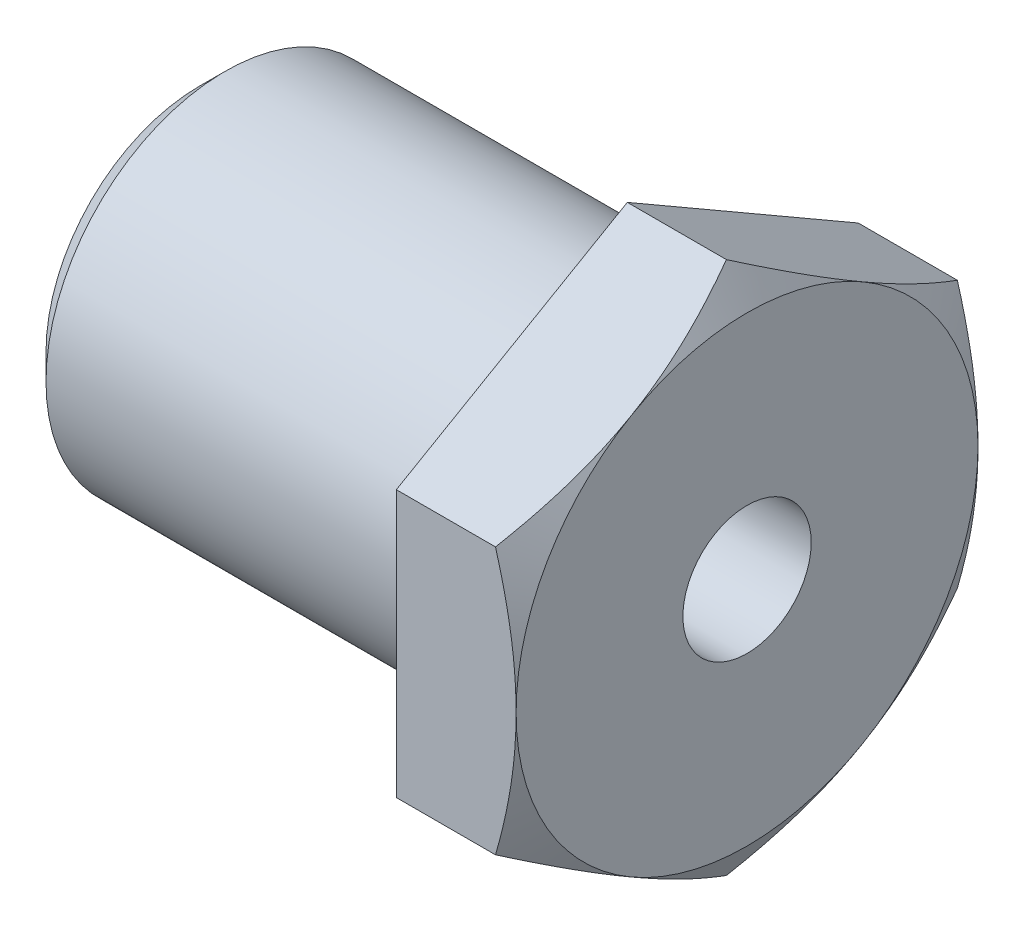
ISO-10303-21;
HEADER;
FILE_DESCRIPTION(('STEP AP214'),'2;1');
FILE_NAME('part.step','',(''),(''),'','','');
FILE_SCHEMA(('AUTOMOTIVE_DESIGN { 1 0 10303 214 1 1 1 1 }'));
ENDSEC;
DATA;
#1=APPLICATION_CONTEXT('core data for automotive mechanical design processes');
#2=APPLICATION_PROTOCOL_DEFINITION('international standard','automotive_design',2000,#1);
#3=PRODUCT_CONTEXT('',#1,'mechanical');
#4=PRODUCT('Part','Part','',(#3));
#5=PRODUCT_RELATED_PRODUCT_CATEGORY('part','',(#4));
#6=PRODUCT_DEFINITION_FORMATION('','',#4);
#7=PRODUCT_DEFINITION_CONTEXT('part definition',#1,'design');
#8=PRODUCT_DEFINITION('design','',#6,#7);
#9=PRODUCT_DEFINITION_SHAPE('','',#8);
#10=(LENGTH_UNIT() NAMED_UNIT(*) SI_UNIT(.MILLI.,.METRE.));
#11=(NAMED_UNIT(*) PLANE_ANGLE_UNIT() SI_UNIT($,.RADIAN.));
#12=(NAMED_UNIT(*) SI_UNIT($,.STERADIAN.) SOLID_ANGLE_UNIT());
#13=UNCERTAINTY_MEASURE_WITH_UNIT(LENGTH_MEASURE(1.E-05),#10,'distance_accuracy_value','');
#14=(GEOMETRIC_REPRESENTATION_CONTEXT(3) GLOBAL_UNCERTAINTY_ASSIGNED_CONTEXT((#13)) GLOBAL_UNIT_ASSIGNED_CONTEXT((#10,
#11,#12)) REPRESENTATION_CONTEXT('',''));
#15=CARTESIAN_POINT('',(0.,0.,0.));
#16=DIRECTION('',(0.,0.,1.));
#17=DIRECTION('',(1.,0.,0.));
#18=AXIS2_PLACEMENT_3D('',#15,#16,#17);
#19=CARTESIAN_POINT('',(-7.,-7.79422863405995,-13.5));
#20=DIRECTION('',(0.,0.,-1.));
#21=DIRECTION('',(-1.,0.,0.));
#22=AXIS2_PLACEMENT_3D('',#19,#20,#21);
#23=PLANE('',#22);
#24=DIRECTION('',(1.,0.,0.));
#25=VECTOR('',#24,1.);
#26=CARTESIAN_POINT('',(-7.,7.79422863405994,-13.5));
#27=LINE('',#26,#25);
#28=CARTESIAN_POINT('',(-7.,7.79422863405994,-13.5));
#29=VERTEX_POINT('',#28);
#30=CARTESIAN_POINT('',(-1.20577136594004,7.79422863405994,-13.5));
#31=VERTEX_POINT('',#30);
#32=EDGE_CURVE('E237',#29,#31,#27,.T.);
#33=ORIENTED_EDGE('',*,*,#32,.T.);
#34=CARTESIAN_POINT('',(-8.54983886763132,24.882436124695,-13.5));
#35=CARTESIAN_POINT('',(-8.25199173430801,24.2954270572265,-13.5));
#36=CARTESIAN_POINT('',(-7.95598138250222,23.7074769622799,-13.5));
#37=CARTESIAN_POINT('',(-7.36853320300015,22.5292561254167,-13.5));
#38=CARTESIAN_POINT('',(-7.07709563916031,21.9389852520275,-13.5));
#39=CARTESIAN_POINT('',(-6.49920119780585,20.7546752322907,-13.5));
#40=CARTESIAN_POINT('',(-6.21275434736899,20.1606311837385,-13.5));
#41=CARTESIAN_POINT('',(-5.64664040289842,18.9693284542594,-13.5));
#42=CARTESIAN_POINT('',(-5.36697318910277,18.3720698303457,-13.5));
#43=CARTESIAN_POINT('',(-4.80255912017447,17.1444390726559,-13.5));
#44=CARTESIAN_POINT('',(-4.51823089792267,16.5138739118577,-13.5));
#45=CARTESIAN_POINT('',(-3.96119981935299,15.2475759329258,-13.5));
#46=CARTESIAN_POINT('',(-3.68849746314119,14.6118428938849,-13.5));
#47=CARTESIAN_POINT('',(-3.15813892349839,13.3345393742085,-13.5));
#48=CARTESIAN_POINT('',(-2.90047407223134,12.6929725077911,-13.5));
#49=CARTESIAN_POINT('',(-2.40436390738466,11.4024494411707,-13.5));
#50=CARTESIAN_POINT('',(-2.16591658855359,10.7534940200115,-13.5));
#51=CARTESIAN_POINT('',(-1.80450619880094,9.70851119562983,-13.5));
#52=CARTESIAN_POINT('',(-1.67353193900609,9.3152548494412,-13.5));
#53=CARTESIAN_POINT('',(-1.42212863347123,8.52539475856635,-13.5));
#54=CARTESIAN_POINT('',(-1.3016989268193,8.12879122538606,-13.5));
#55=CARTESIAN_POINT('',(-1.0731045781354,7.33200476958767,-13.5));
#56=CARTESIAN_POINT('',(-0.964941139983652,6.93182149978545,-13.5));
#57=CARTESIAN_POINT('',(-0.762829476119003,6.12785860408257,-13.5));
#58=CARTESIAN_POINT('',(-0.668881193433303,5.72407899260254,-13.5));
#59=CARTESIAN_POINT('',(-0.498804847909883,4.92040617114928,-13.5));
#60=CARTESIAN_POINT('',(-0.422384551807951,4.52057524658855,-13.5));
#61=CARTESIAN_POINT('',(-0.287143150094838,3.71792839492585,-13.5));
#62=CARTESIAN_POINT('',(-0.2283217644496,3.31511251542503,-13.5));
#63=CARTESIAN_POINT('',(-0.130010303491392,2.50728136792285,-13.5));
#64=CARTESIAN_POINT('',(-0.0905119321156918,2.10226711940976,-13.5));
#65=CARTESIAN_POINT('',(-0.0320941965918444,1.29074616946189,-13.5));
#66=CARTESIAN_POINT('',(-0.0131746152860358,0.884239483821471,-13.5));
#67=CARTESIAN_POINT('',(0.00350509157391289,0.0669139098477597,-13.5));
#68=CARTESIAN_POINT('',(0.00106204169040904,-0.343909185170782,-13.5));
#69=CARTESIAN_POINT('',(-0.0253813055302253,-1.16485624100865,-13.5));
#70=CARTESIAN_POINT('',(-0.0493817834244995,-1.57498019594341,-13.5));
#71=CARTESIAN_POINT('',(-0.118109840908565,-2.39361863248795,-13.5));
#72=CARTESIAN_POINT('',(-0.162844907369479,-2.80213247893854,-13.5));
#73=CARTESIAN_POINT('',(-0.271595185427442,-3.61656828665505,-13.5));
#74=CARTESIAN_POINT('',(-0.335610774222303,-4.02249019705451,-13.5));
#75=CARTESIAN_POINT('',(-0.482442708459133,-4.83870828261852,-13.5));
#76=CARTESIAN_POINT('',(-0.565587291853277,-5.24894493436057,-13.5));
#77=CARTESIAN_POINT('',(-0.747880354825969,-6.06587709215787,-13.5));
#78=CARTESIAN_POINT('',(-0.847031007287959,-6.47257210951151,-13.5));
#79=CARTESIAN_POINT('',(-1.05924091269877,-7.28230513852935,-13.5));
#80=CARTESIAN_POINT('',(-1.17230048855684,-7.68534306505728,-13.5));
#81=CARTESIAN_POINT('',(-1.41038677841647,-8.48782858284051,-13.5));
#82=CARTESIAN_POINT('',(-1.53541302763187,-8.88727631288055,-13.5));
#83=CARTESIAN_POINT('',(-1.89219150953685,-9.97780933709844,-13.5));
#84=CARTESIAN_POINT('',(-2.13433291869646,-10.6654959844299,-13.5));
#85=CARTESIAN_POINT('',(-2.64207630078369,-12.0321550203257,-13.5));
#86=CARTESIAN_POINT('',(-2.90768184883965,-12.7111260628188,-13.5));
#87=CARTESIAN_POINT('',(-3.45696447301505,-14.0622986652198,-13.5));
#88=CARTESIAN_POINT('',(-3.74065548796467,-14.7344945297912,-13.5));
#89=CARTESIAN_POINT('',(-4.32176609668475,-16.0728456920435,-13.5));
#90=CARTESIAN_POINT('',(-4.61918483496837,-16.7390013630511,-13.5));
#91=CARTESIAN_POINT('',(-5.20985281777802,-18.0337977898197,-13.5));
#92=CARTESIAN_POINT('',(-5.50258879726842,-18.662673474907,-13.5));
#93=CARTESIAN_POINT('',(-6.09579986044871,-19.9167740871208,-13.5));
#94=CARTESIAN_POINT('',(-6.39627512592224,-20.5419989280709,-13.5));
#95=CARTESIAN_POINT('',(-7.00273196808285,-21.7878873378944,-13.5));
#96=CARTESIAN_POINT('',(-7.30869837435879,-22.4085583022183,-13.5));
#97=CARTESIAN_POINT('',(-7.77144938020335,-23.3376402510691,-13.5));
#98=CARTESIAN_POINT('',(-7.92632792389112,-23.6470029453277,-13.5));
#99=CARTESIAN_POINT('',(-8.23724283907324,-24.265144285418,-13.5));
#100=CARTESIAN_POINT('',(-8.3932792052836,-24.573922933907,-13.5));
#101=CARTESIAN_POINT('',(-8.54983886763133,-24.882436124695,-13.5));
#102=B_SPLINE_CURVE_WITH_KNOTS('',3,(#34,#35,#36,#37,#38,#39,#40,#41,#42,#43,#44,#45,#46,#47,
#48,#49,#50,#51,#52,#53,#54,#55,#56,#57,#58,#59,#60,#61,#62,#63,#64,#65,#66,#67,#68,#69,#70,#71,
#72,#73,#74,#75,#76,#77,#78,#79,#80,#81,#82,#83,#84,#85,#86,#87,#88,#89,#90,#91,#92,#93,#94,#95,
#96,#97,#98,#99,#100,#101),.UNSPECIFIED.,.F.,.F.,(4,2,2,2,2,2,2,2,2,2,2,2,2,2,2,2,2,2,2,2,2,2,2,
2,2,2,2,2,2,2,2,2,2,4),(0.,1.97475765761037,3.94962884561572,5.92809327629299,7.90652273199096,
9.98154483319963,12.0566561050734,14.1305591924174,16.2042455976268,17.4476062122393,
18.6908888395758,19.9342933842149,21.177692945292,22.3985468093385,23.6193812461115,
24.8396910738904,26.0599880242261,27.291903490438,28.5238292748202,29.7562002314529,
30.9885952993528,32.243964767013,33.4995047992853,34.7550739856485,36.0105944254202,
38.197177823334,40.3840949579194,42.5727184616526,44.761205758001,46.8421538316759,
48.9231508281941,50.9990862833045,52.0369830764296,53.0748751357785),.UNSPECIFIED.);
#103=CARTESIAN_POINT('',(0.,0.,-13.5));
#104=VERTEX_POINT('',#103);
#105=EDGE_CURVE('E65',#31,#104,#102,.T.);
#106=ORIENTED_EDGE('',*,*,#105,.T.);
#107=CARTESIAN_POINT('',(-1.20577136594004,-7.79422863405995,-13.5));
#108=VERTEX_POINT('',#107);
#109=EDGE_CURVE('E178',#104,#108,#102,.T.);
#110=ORIENTED_EDGE('',*,*,#109,.T.);
#111=DIRECTION('',(1.,0.,0.));
#112=VECTOR('',#111,1.);
#113=CARTESIAN_POINT('',(-7.,-7.79422863405995,-13.5));
#114=LINE('',#113,#112);
#115=CARTESIAN_POINT('',(-7.,-7.79422863405995,-13.5));
#116=VERTEX_POINT('',#115);
#117=EDGE_CURVE('E257',#116,#108,#114,.T.);
#118=ORIENTED_EDGE('',*,*,#117,.F.);
#119=DIRECTION('',(0.,1.,0.));
#120=VECTOR('',#119,1.);
#121=CARTESIAN_POINT('',(-7.,-7.79422863405995,-13.5));
#122=LINE('',#121,#120);
#123=EDGE_CURVE('E240',#116,#29,#122,.T.);
#124=ORIENTED_EDGE('',*,*,#123,.T.);
#125=EDGE_LOOP('',(#33,#106,#110,#118,#124));
#126=FACE_BOUND('',#125,.T.);
#127=ADVANCED_FACE('F43',(#126),#23,.T.);
#128=CARTESIAN_POINT('',(-7.,-15.5884572681199,0.));
#129=DIRECTION('',(0.,-0.866025403784439,-0.5));
#130=DIRECTION('',(0.,0.5,-0.866025403784439));
#131=AXIS2_PLACEMENT_3D('',#128,#129,#130);
#132=PLANE('',#131);
#133=ORIENTED_EDGE('',*,*,#117,.T.);
#134=CARTESIAN_POINT('',(-1.20583803334745,-7.79411316400611,-13.5002));
#135=CARTESIAN_POINT('',(-1.10693600185288,-7.9654273431049,-13.2034751377439));
#136=CARTESIAN_POINT('',(-1.01252193890574,-8.13740973961966,-12.9055928889729));
#137=CARTESIAN_POINT('',(-0.83391725487825,-8.48275363037184,-12.3074397241066));
#138=CARTESIAN_POINT('',(-0.749729996263838,-8.65611555833005,-12.0071680567849));
#139=CARTESIAN_POINT('',(-0.592710566835619,-9.00455355753,-11.4036557388829));
#140=CARTESIAN_POINT('',(-0.519905262595242,-9.17963267786847,-11.1004098071123));
#141=CARTESIAN_POINT('',(-0.387213084407287,-9.53100751002426,-10.4918107453174));
#142=CARTESIAN_POINT('',(-0.327325473477572,-9.7073031518439,-10.1864577365329));
#143=CARTESIAN_POINT('',(-0.223015910639062,-10.0565936504728,-9.58146884630662));
#144=CARTESIAN_POINT('',(-0.17824871362455,-10.2295625754616,-9.28187788009544));
#145=CARTESIAN_POINT('',(-0.103183935683262,-10.5762930076628,-8.68132315499258));
#146=CARTESIAN_POINT('',(-0.0728866332670102,-10.7500545300658,-8.38035936979));
#147=CARTESIAN_POINT('',(-0.0275266341970769,-11.0978694745929,-7.77792621423743));
#148=CARTESIAN_POINT('',(-0.0124458340286902,-11.2719223024903,-7.47645787311808));
#149=CARTESIAN_POINT('',(0.00215683633240038,-11.6201886315474,-6.87324289662571));
#150=CARTESIAN_POINT('',(0.00167918727246993,-11.7944021275762,-6.57149627013963));
#151=CARTESIAN_POINT('',(-0.0137483336445648,-12.1200937136619,-6.00738189544142));
#152=CARTESIAN_POINT('',(-0.0268164189930285,-12.271595012447,-5.74497394853304));
#153=CARTESIAN_POINT('',(-0.064472569958598,-12.5742491226741,-5.2207616525001));
#154=CARTESIAN_POINT('',(-0.0890614504269839,-12.7254019087062,-4.95895734738681));
#155=CARTESIAN_POINT('',(-0.149330465436021,-13.0272768920407,-4.43609453871756));
#156=CARTESIAN_POINT('',(-0.185019760507134,-13.1779986295677,-4.17503683151571));
#157=CARTESIAN_POINT('',(-0.26686343871233,-13.4787354904687,-3.65414530872634));
#158=CARTESIAN_POINT('',(-0.313018533291657,-13.6287505650971,-3.39431157756869));
#159=CARTESIAN_POINT('',(-0.468349259272654,-14.0841296870377,-2.60557180166152));
#160=CARTESIAN_POINT('',(-0.593013033425384,-14.3881750256073,-2.07894982745446));
#161=CARTESIAN_POINT('',(-0.875948867571979,-14.9917319951217,-1.03355849099333));
#162=CARTESIAN_POINT('',(-1.03415447837319,-15.2912513537195,-0.514775744051513));
#163=CARTESIAN_POINT('',(-1.20583803334744,-15.5885727381737,0.000200000000003347));
#164=B_SPLINE_CURVE_WITH_KNOTS('',3,(#134,#135,#136,#137,#138,#139,#140,#141,#142,#143,#144,
#145,#146,#147,#148,#149,#150,#151,#152,#153,#154,#155,#156,#157,#158,#159,#160,#161,#162,#163),
.UNSPECIFIED.,.F.,.F.,(4,2,2,2,2,2,2,2,2,2,2,2,2,2,4),(0.,1.0698794936454,2.14010980578041,
3.21282939735429,4.28548777177525,5.33167033690336,6.37787303770781,7.42282956789444,
8.46775380954026,9.37738732544599,10.2870851882952,11.1975357730373,12.1080482670512,
13.9691139233208,15.8265265395635),.UNSPECIFIED.);
#165=CARTESIAN_POINT('',(0.,-11.6913429510899,-6.75));
#166=VERTEX_POINT('',#165);
#167=EDGE_CURVE('E536',#108,#166,#164,.T.);
#168=ORIENTED_EDGE('',*,*,#167,.T.);
#169=CARTESIAN_POINT('',(-1.20577136594004,-15.5884572681199,0.));
#170=VERTEX_POINT('',#169);
#171=EDGE_CURVE('E205',#166,#170,#164,.T.);
#172=ORIENTED_EDGE('',*,*,#171,.T.);
#173=DIRECTION('',(1.,0.,0.));
#174=VECTOR('',#173,1.);
#175=CARTESIAN_POINT('',(-7.,-15.5884572681199,0.));
#176=LINE('',#175,#174);
#177=CARTESIAN_POINT('',(-7.,-15.5884572681199,0.));
#178=VERTEX_POINT('',#177);
#179=EDGE_CURVE('E547',#178,#170,#176,.T.);
#180=ORIENTED_EDGE('',*,*,#179,.F.);
#181=DIRECTION('',(0.,0.5,-0.866025403784439));
#182=VECTOR('',#181,1.);
#183=CARTESIAN_POINT('',(-7.,-15.5884572681199,0.));
#184=LINE('',#183,#182);
#185=EDGE_CURVE('E243',#178,#116,#184,.T.);
#186=ORIENTED_EDGE('',*,*,#185,.T.);
#187=EDGE_LOOP('',(#133,#168,#172,#180,#186));
#188=FACE_BOUND('',#187,.T.);
#189=ADVANCED_FACE('F215',(#188),#132,.T.);
#190=CARTESIAN_POINT('',(-7.,-7.79422863405994,13.5));
#191=DIRECTION('',(0.,-0.866025403784438,0.5));
#192=DIRECTION('',(0.,-0.5,-0.866025403784439));
#193=AXIS2_PLACEMENT_3D('',#190,#191,#192);
#194=PLANE('',#193);
#195=ORIENTED_EDGE('',*,*,#179,.T.);
#196=CARTESIAN_POINT('',(-1.20583803334745,-15.5885727381737,-0.000199999999994378));
#197=CARTESIAN_POINT('',(-1.10693600185288,-15.4172585590749,0.296524862256059));
#198=CARTESIAN_POINT('',(-1.01252193890574,-15.2452761625602,0.594407111027077));
#199=CARTESIAN_POINT('',(-0.833917254878251,-14.899932271808,1.19256027589337));
#200=CARTESIAN_POINT('',(-0.749729996263837,-14.7265703438498,1.49283194321509));
#201=CARTESIAN_POINT('',(-0.592710566835618,-14.3781323446498,2.09634426111705));
#202=CARTESIAN_POINT('',(-0.519905262595242,-14.2030532243114,2.39959019288773));
#203=CARTESIAN_POINT('',(-0.387213084407288,-13.8516783921556,3.00818925468256));
#204=CARTESIAN_POINT('',(-0.327325473477573,-13.6753827503359,3.31354226346714));
#205=CARTESIAN_POINT('',(-0.223015910639062,-13.3260922517071,3.91853115369338));
#206=CARTESIAN_POINT('',(-0.17824871362455,-13.1531233267183,4.21812211990456));
#207=CARTESIAN_POINT('',(-0.103183935683261,-12.806392894517,4.81867684500742));
#208=CARTESIAN_POINT('',(-0.0728866332670104,-12.632631372114,5.11964063021));
#209=CARTESIAN_POINT('',(-0.0275266341970777,-12.284816427587,5.72207378576257));
#210=CARTESIAN_POINT('',(-0.0124458340286911,-12.1107635996896,6.02354212688192));
#211=CARTESIAN_POINT('',(0.00215683633239986,-11.7624972706325,6.62675710337429));
#212=CARTESIAN_POINT('',(0.00167918727246999,-11.5882837746037,6.92850372986036));
#213=CARTESIAN_POINT('',(-0.0137483336445649,-11.2625921885179,7.49261810455858));
#214=CARTESIAN_POINT('',(-0.026816418993029,-11.1110908897329,7.75502605146696));
#215=CARTESIAN_POINT('',(-0.0644725699585984,-10.8084367795058,8.27923834749989));
#216=CARTESIAN_POINT('',(-0.0890614504269837,-10.6572839934736,8.54104265261319));
#217=CARTESIAN_POINT('',(-0.149330465436021,-10.3554090101392,9.06390546128244));
#218=CARTESIAN_POINT('',(-0.185019760507135,-10.2046872726121,9.32496316848429));
#219=CARTESIAN_POINT('',(-0.266863438712332,-9.9039504117111,9.84585469127366));
#220=CARTESIAN_POINT('',(-0.313018533291658,-9.75393533708269,10.1056884224313));
#221=CARTESIAN_POINT('',(-0.468349259272654,-9.29855621514212,10.8944281983385));
#222=CARTESIAN_POINT('',(-0.593013033425385,-8.99451087657251,11.4210501725455));
#223=CARTESIAN_POINT('',(-0.875948867571981,-8.39095390705817,12.4664415090067));
#224=CARTESIAN_POINT('',(-1.0341544783732,-8.09143454846038,12.9852242559485));
#225=CARTESIAN_POINT('',(-1.20583803334745,-7.79411316400611,13.5002));
#226=B_SPLINE_CURVE_WITH_KNOTS('',3,(#196,#197,#198,#199,#200,#201,#202,#203,#204,#205,#206,
#207,#208,#209,#210,#211,#212,#213,#214,#215,#216,#217,#218,#219,#220,#221,#222,#223,#224,#225),
.UNSPECIFIED.,.F.,.F.,(4,2,2,2,2,2,2,2,2,2,2,2,2,2,4),(0.,1.0698794936454,2.14010980578041,
3.21282939735429,4.28548777177525,5.33167033690336,6.37787303770781,7.42282956789443,
8.46775380954026,9.37738732544599,10.2870851882952,11.1975357730373,12.1080482670512,
13.9691139233208,15.8265265395635),.UNSPECIFIED.);
#227=CARTESIAN_POINT('',(0.,-11.6913429510899,6.75));
#228=VERTEX_POINT('',#227);
#229=EDGE_CURVE('E203',#170,#228,#226,.T.);
#230=ORIENTED_EDGE('',*,*,#229,.T.);
#231=CARTESIAN_POINT('',(-1.20577136594004,-7.79422863405994,13.5));
#232=VERTEX_POINT('',#231);
#233=EDGE_CURVE('E195',#228,#232,#226,.T.);
#234=ORIENTED_EDGE('',*,*,#233,.T.);
#235=DIRECTION('',(1.,0.,0.));
#236=VECTOR('',#235,1.);
#237=CARTESIAN_POINT('',(-7.,-7.79422863405994,13.5));
#238=LINE('',#237,#236);
#239=CARTESIAN_POINT('',(-7.,-7.79422863405994,13.5));
#240=VERTEX_POINT('',#239);
#241=EDGE_CURVE('E556',#240,#232,#238,.T.);
#242=ORIENTED_EDGE('',*,*,#241,.F.);
#243=DIRECTION('',(0.,-0.5,-0.866025403784439));
#244=VECTOR('',#243,1.);
#245=CARTESIAN_POINT('',(-7.,-7.79422863405994,13.5));
#246=LINE('',#245,#244);
#247=EDGE_CURVE('E251',#240,#178,#246,.T.);
#248=ORIENTED_EDGE('',*,*,#247,.T.);
#249=EDGE_LOOP('',(#195,#230,#234,#242,#248));
#250=FACE_BOUND('',#249,.T.);
#251=ADVANCED_FACE('F211',(#250),#194,.T.);
#252=CARTESIAN_POINT('',(-7.,7.79422863405996,13.5));
#253=DIRECTION('',(0.,0.,1.));
#254=DIRECTION('',(0.,-1.,0.));
#255=AXIS2_PLACEMENT_3D('',#252,#253,#254);
#256=PLANE('',#255);
#257=ORIENTED_EDGE('',*,*,#241,.T.);
#258=CARTESIAN_POINT('',(-8.54983886763133,-24.882436124695,13.5));
#259=CARTESIAN_POINT('',(-8.25199173430801,-24.2954270572265,13.5));
#260=CARTESIAN_POINT('',(-7.95598138250222,-23.7074769622799,13.5));
#261=CARTESIAN_POINT('',(-7.36853320300016,-22.5292561254167,13.5));
#262=CARTESIAN_POINT('',(-7.07709563916031,-21.9389852520275,13.5));
#263=CARTESIAN_POINT('',(-6.49920119780585,-20.7546752322907,13.5));
#264=CARTESIAN_POINT('',(-6.21275434736899,-20.1606311837385,13.5));
#265=CARTESIAN_POINT('',(-5.64664040289842,-18.9693284542594,13.5));
#266=CARTESIAN_POINT('',(-5.36697318910277,-18.3720698303457,13.5));
#267=CARTESIAN_POINT('',(-4.80255912017447,-17.1444390726559,13.5));
#268=CARTESIAN_POINT('',(-4.51823089792267,-16.5138739118577,13.5));
#269=CARTESIAN_POINT('',(-3.96119981935299,-15.2475759329258,13.5));
#270=CARTESIAN_POINT('',(-3.6884974631412,-14.6118428938849,13.5));
#271=CARTESIAN_POINT('',(-3.15813892349839,-13.3345393742085,13.5));
#272=CARTESIAN_POINT('',(-2.90047407223134,-12.6929725077911,13.5));
#273=CARTESIAN_POINT('',(-2.40436390738466,-11.4024494411707,13.5));
#274=CARTESIAN_POINT('',(-2.16591658855359,-10.7534940200115,13.5));
#275=CARTESIAN_POINT('',(-1.80450619880095,-9.70851119562984,13.5));
#276=CARTESIAN_POINT('',(-1.6735319390061,-9.31525484944121,13.5));
#277=CARTESIAN_POINT('',(-1.42212863347123,-8.52539475856636,13.5));
#278=CARTESIAN_POINT('',(-1.3016989268193,-8.12879122538607,13.5));
#279=CARTESIAN_POINT('',(-1.0731045781354,-7.33200476958767,13.5));
#280=CARTESIAN_POINT('',(-0.964941139983655,-6.93182149978545,13.5));
#281=CARTESIAN_POINT('',(-0.762829476119005,-6.12785860408258,13.5));
#282=CARTESIAN_POINT('',(-0.668881193433306,-5.72407899260254,13.5));
#283=CARTESIAN_POINT('',(-0.498804847909885,-4.92040617114928,13.5));
#284=CARTESIAN_POINT('',(-0.422384551807952,-4.52057524658856,13.5));
#285=CARTESIAN_POINT('',(-0.28714315009484,-3.71792839492585,13.5));
#286=CARTESIAN_POINT('',(-0.228321764449602,-3.31511251542503,13.5));
#287=CARTESIAN_POINT('',(-0.130010303491395,-2.50728136792285,13.5));
#288=CARTESIAN_POINT('',(-0.0905119321156947,-2.10226711940977,13.5));
#289=CARTESIAN_POINT('',(-0.0320941965918468,-1.2907461694619,13.5));
#290=CARTESIAN_POINT('',(-0.0131746152860376,-0.884239483821474,13.5));
#291=CARTESIAN_POINT('',(0.00350509157391165,-0.0669139098477612,13.5));
#292=CARTESIAN_POINT('',(0.00106204169040771,0.343909185170781,13.5));
#293=CARTESIAN_POINT('',(-0.0253813055302269,1.16485624100865,13.5));
#294=CARTESIAN_POINT('',(-0.049381783424501,1.57498019594341,13.5));
#295=CARTESIAN_POINT('',(-0.118109840908566,2.39361863248795,13.5));
#296=CARTESIAN_POINT('',(-0.16284490736948,2.80213247893854,13.5));
#297=CARTESIAN_POINT('',(-0.271595185427444,3.61656828665505,13.5));
#298=CARTESIAN_POINT('',(-0.335610774222304,4.02249019705451,13.5));
#299=CARTESIAN_POINT('',(-0.482442708459134,4.83870828261853,13.5));
#300=CARTESIAN_POINT('',(-0.565587291853277,5.24894493436057,13.5));
#301=CARTESIAN_POINT('',(-0.74788035482597,6.06587709215787,13.5));
#302=CARTESIAN_POINT('',(-0.847031007287961,6.47257210951151,13.5));
#303=CARTESIAN_POINT('',(-1.05924091269878,7.28230513852936,13.5));
#304=CARTESIAN_POINT('',(-1.17230048855685,7.68534306505729,13.5));
#305=CARTESIAN_POINT('',(-1.41038677841647,8.48782858284052,13.5));
#306=CARTESIAN_POINT('',(-1.53541302763187,8.88727631288056,13.5));
#307=CARTESIAN_POINT('',(-1.89219150953685,9.97780933709844,13.5));
#308=CARTESIAN_POINT('',(-2.13433291869646,10.6654959844299,13.5));
#309=CARTESIAN_POINT('',(-2.64207630078369,12.0321550203257,13.5));
#310=CARTESIAN_POINT('',(-2.90768184883966,12.7111260628188,13.5));
#311=CARTESIAN_POINT('',(-3.45696447301506,14.0622986652198,13.5));
#312=CARTESIAN_POINT('',(-3.74065548796468,14.7344945297912,13.5));
#313=CARTESIAN_POINT('',(-4.32176609668475,16.0728456920435,13.5));
#314=CARTESIAN_POINT('',(-4.61918483496838,16.7390013630511,13.5));
#315=CARTESIAN_POINT('',(-5.20985281777802,18.0337977898197,13.5));
#316=CARTESIAN_POINT('',(-5.50258879726842,18.662673474907,13.5));
#317=CARTESIAN_POINT('',(-6.09579986044872,19.9167740871208,13.5));
#318=CARTESIAN_POINT('',(-6.39627512592224,20.5419989280709,13.5));
#319=CARTESIAN_POINT('',(-7.00273196808286,21.7878873378944,13.5));
#320=CARTESIAN_POINT('',(-7.30869837435879,22.4085583022184,13.5));
#321=CARTESIAN_POINT('',(-7.77144938020335,23.3376402510691,13.5));
#322=CARTESIAN_POINT('',(-7.92632792389112,23.6470029453277,13.5));
#323=CARTESIAN_POINT('',(-8.23724283907324,24.265144285418,13.5));
#324=CARTESIAN_POINT('',(-8.3932792052836,24.573922933907,13.5));
#325=CARTESIAN_POINT('',(-8.54983886763133,24.882436124695,13.5));
#326=B_SPLINE_CURVE_WITH_KNOTS('',3,(#258,#259,#260,#261,#262,#263,#264,#265,#266,#267,#268,
#269,#270,#271,#272,#273,#274,#275,#276,#277,#278,#279,#280,#281,#282,#283,#284,#285,#286,#287,
#288,#289,#290,#291,#292,#293,#294,#295,#296,#297,#298,#299,#300,#301,#302,#303,#304,#305,#306,
#307,#308,#309,#310,#311,#312,#313,#314,#315,#316,#317,#318,#319,#320,#321,#322,#323,#324,#325),
.UNSPECIFIED.,.F.,.F.,(4,2,2,2,2,2,2,2,2,2,2,2,2,2,2,2,2,2,2,2,2,2,2,2,2,2,2,2,2,2,2,2,2,4),(0.,
1.97475765761037,3.94962884561572,5.92809327629298,7.90652273199096,9.98154483319964,
12.0566561050734,14.1305591924174,16.2042455976268,17.4476062122393,18.6908888395758,
19.9342933842149,21.177692945292,22.3985468093385,23.6193812461115,24.8396910738904,
26.0599880242261,27.291903490438,28.5238292748202,29.7562002314529,30.9885952993528,
32.243964767013,33.4995047992853,34.7550739856485,36.0105944254202,38.197177823334,
40.3840949579194,42.5727184616526,44.761205758001,46.8421538316759,48.9231508281941,
50.9990862833045,52.0369830764296,53.0748751357785),.UNSPECIFIED.);
#327=CARTESIAN_POINT('',(0.,0.,13.5));
#328=VERTEX_POINT('',#327);
#329=EDGE_CURVE('E204',#232,#328,#326,.T.);
#330=ORIENTED_EDGE('',*,*,#329,.T.);
#331=CARTESIAN_POINT('',(-1.20577136594005,7.79422863405996,13.5));
#332=VERTEX_POINT('',#331);
#333=EDGE_CURVE('E188',#328,#332,#326,.T.);
#334=ORIENTED_EDGE('',*,*,#333,.T.);
#335=DIRECTION('',(1.,0.,0.));
#336=VECTOR('',#335,1.);
#337=CARTESIAN_POINT('',(-7.,7.79422863405996,13.5));
#338=LINE('',#337,#336);
#339=CARTESIAN_POINT('',(-7.,7.79422863405996,13.5));
#340=VERTEX_POINT('',#339);
#341=EDGE_CURVE('E248',#340,#332,#338,.T.);
#342=ORIENTED_EDGE('',*,*,#341,.F.);
#343=DIRECTION('',(0.,-1.,0.));
#344=VECTOR('',#343,1.);
#345=CARTESIAN_POINT('',(-7.,7.79422863405996,13.5));
#346=LINE('',#345,#344);
#347=EDGE_CURVE('E561',#340,#240,#346,.T.);
#348=ORIENTED_EDGE('',*,*,#347,.T.);
#349=EDGE_LOOP('',(#257,#330,#334,#342,#348));
#350=FACE_BOUND('',#349,.T.);
#351=ADVANCED_FACE('F214',(#350),#256,.T.);
#352=CARTESIAN_POINT('',(-7.,15.5884572681199,0.));
#353=DIRECTION('',(0.,0.866025403784439,0.5));
#354=DIRECTION('',(0.,-0.5,0.866025403784439));
#355=AXIS2_PLACEMENT_3D('',#352,#353,#354);
#356=PLANE('',#355);
#357=ORIENTED_EDGE('',*,*,#341,.T.);
#358=CARTESIAN_POINT('',(-1.20583803334745,7.79411316400612,13.5002));
#359=CARTESIAN_POINT('',(-1.10693600185288,7.9654273431049,13.2034751377439));
#360=CARTESIAN_POINT('',(-1.01252193890575,8.13740973961966,12.9055928889729));
#361=CARTESIAN_POINT('',(-0.833917254878252,8.48275363037184,12.3074397241066));
#362=CARTESIAN_POINT('',(-0.74972999626384,8.65611555833006,12.0071680567849));
#363=CARTESIAN_POINT('',(-0.59271056683562,9.00455355753001,11.4036557388829));
#364=CARTESIAN_POINT('',(-0.519905262595242,9.17963267786847,11.1004098071123));
#365=CARTESIAN_POINT('',(-0.387213084407288,9.53100751002427,10.4918107453174));
#366=CARTESIAN_POINT('',(-0.327325473477573,9.70730315184391,10.1864577365329));
#367=CARTESIAN_POINT('',(-0.223015910639064,10.0565936504728,9.58146884630662));
#368=CARTESIAN_POINT('',(-0.178248713624552,10.2295625754616,9.28187788009544));
#369=CARTESIAN_POINT('',(-0.103183935683264,10.5762930076628,8.68132315499258));
#370=CARTESIAN_POINT('',(-0.0728866332670133,10.7500545300658,8.38035936979));
#371=CARTESIAN_POINT('',(-0.0275266341970798,11.0978694745929,7.77792621423742));
#372=CARTESIAN_POINT('',(-0.0124458340286923,11.2719223024903,7.47645787311808));
#373=CARTESIAN_POINT('',(0.00215683633239852,11.6201886315474,6.8732428966257));
#374=CARTESIAN_POINT('',(0.00167918727246774,11.7944021275762,6.57149627013963));
#375=CARTESIAN_POINT('',(-0.0137483336445671,12.1200937136619,6.00738189544142));
#376=CARTESIAN_POINT('',(-0.0268164189930307,12.271595012447,5.74497394853304));
#377=CARTESIAN_POINT('',(-0.0644725699586004,12.5742491226741,5.22076165250011));
#378=CARTESIAN_POINT('',(-0.0890614504269866,12.7254019087062,4.95895734738681));
#379=CARTESIAN_POINT('',(-0.149330465436024,13.0272768920407,4.43609453871756));
#380=CARTESIAN_POINT('',(-0.185019760507137,13.1779986295677,4.17503683151571));
#381=CARTESIAN_POINT('',(-0.266863438712334,13.4787354904687,3.65414530872634));
#382=CARTESIAN_POINT('',(-0.313018533291661,13.6287505650972,3.39431157756869));
#383=CARTESIAN_POINT('',(-0.468349259272657,14.0841296870377,2.60557180166152));
#384=CARTESIAN_POINT('',(-0.593013033425388,14.3881750256073,2.07894982745446));
#385=CARTESIAN_POINT('',(-0.875948867571983,14.9917319951217,1.03355849099333));
#386=CARTESIAN_POINT('',(-1.0341544783732,15.2912513537195,0.514775744051517));
#387=CARTESIAN_POINT('',(-1.20583803334745,15.5885727381737,-0.000200000000000378));
#388=B_SPLINE_CURVE_WITH_KNOTS('',3,(#358,#359,#360,#361,#362,#363,#364,#365,#366,#367,#368,
#369,#370,#371,#372,#373,#374,#375,#376,#377,#378,#379,#380,#381,#382,#383,#384,#385,#386,#387),
.UNSPECIFIED.,.F.,.F.,(4,2,2,2,2,2,2,2,2,2,2,2,2,2,4),(0.,1.06987949364541,2.14010980578041,
3.21282939735429,4.28548777177525,5.33167033690336,6.37787303770781,7.42282956789444,
8.46775380954027,9.37738732544599,10.2870851882952,11.1975357730373,12.1080482670512,
13.9691139233208,15.8265265395635),.UNSPECIFIED.);
#389=CARTESIAN_POINT('',(0.,11.6913429510899,6.75));
#390=VERTEX_POINT('',#389);
#391=EDGE_CURVE('E150',#332,#390,#388,.T.);
#392=ORIENTED_EDGE('',*,*,#391,.T.);
#393=CARTESIAN_POINT('',(-1.20577136594005,15.5884572681199,0.));
#394=VERTEX_POINT('',#393);
#395=EDGE_CURVE('E127',#390,#394,#388,.T.);
#396=ORIENTED_EDGE('',*,*,#395,.T.);
#397=DIRECTION('',(1.,0.,0.));
#398=VECTOR('',#397,1.);
#399=CARTESIAN_POINT('',(-7.,15.5884572681199,0.));
#400=LINE('',#399,#398);
#401=CARTESIAN_POINT('',(-7.,15.5884572681199,0.));
#402=VERTEX_POINT('',#401);
#403=EDGE_CURVE('E146',#402,#394,#400,.T.);
#404=ORIENTED_EDGE('',*,*,#403,.F.);
#405=DIRECTION('',(0.,-0.5,0.866025403784439));
#406=VECTOR('',#405,1.);
#407=CARTESIAN_POINT('',(-7.,15.5884572681199,0.));
#408=LINE('',#407,#406);
#409=EDGE_CURVE('E565',#402,#340,#408,.T.);
#410=ORIENTED_EDGE('',*,*,#409,.T.);
#411=EDGE_LOOP('',(#357,#392,#396,#404,#410));
#412=FACE_BOUND('',#411,.T.);
#413=ADVANCED_FACE('F220',(#412),#356,.T.);
#414=CARTESIAN_POINT('',(-7.,7.79422863405994,-13.5));
#415=DIRECTION('',(0.,0.866025403784438,-0.5));
#416=DIRECTION('',(0.,0.5,0.866025403784439));
#417=AXIS2_PLACEMENT_3D('',#414,#415,#416);
#418=PLANE('',#417);
#419=ORIENTED_EDGE('',*,*,#403,.T.);
#420=CARTESIAN_POINT('',(-1.20583803334745,15.5885727381737,0.000199999999999535));
#421=CARTESIAN_POINT('',(-1.10693600185288,15.4172585590749,-0.296524862256055));
#422=CARTESIAN_POINT('',(-1.01252193890575,15.2452761625602,-0.594407111027074));
#423=CARTESIAN_POINT('',(-0.833917254878252,14.899932271808,-1.19256027589336));
#424=CARTESIAN_POINT('',(-0.749729996263838,14.7265703438498,-1.49283194321508));
#425=CARTESIAN_POINT('',(-0.592710566835618,14.3781323446498,-2.09634426111705));
#426=CARTESIAN_POINT('',(-0.519905262595241,14.2030532243114,-2.39959019288773));
#427=CARTESIAN_POINT('',(-0.387213084407287,13.8516783921556,-3.00818925468256));
#428=CARTESIAN_POINT('',(-0.327325473477572,13.6753827503359,-3.31354226346714));
#429=CARTESIAN_POINT('',(-0.223015910639062,13.3260922517071,-3.91853115369338));
#430=CARTESIAN_POINT('',(-0.17824871362455,13.1531233267183,-4.21812211990455));
#431=CARTESIAN_POINT('',(-0.103183935683262,12.806392894517,-4.81867684500741));
#432=CARTESIAN_POINT('',(-0.0728866332670108,12.632631372114,-5.11964063020999));
#433=CARTESIAN_POINT('',(-0.0275266341970773,12.284816427587,-5.72207378576257));
#434=CARTESIAN_POINT('',(-0.0124458340286903,12.1107635996896,-6.02354212688191));
#435=CARTESIAN_POINT('',(0.00215683633240104,11.7624972706325,-6.62675710337429));
#436=CARTESIAN_POINT('',(0.00167918727247119,11.5882837746037,-6.92850372986036));
#437=CARTESIAN_POINT('',(-0.0137483336445636,11.2625921885179,-7.49261810455858));
#438=CARTESIAN_POINT('',(-0.0268164189930276,11.1110908897329,-7.75502605146696));
#439=CARTESIAN_POINT('',(-0.0644725699585973,10.8084367795058,-8.27923834749989));
#440=CARTESIAN_POINT('',(-0.0890614504269831,10.6572839934736,-8.54104265261318));
#441=CARTESIAN_POINT('',(-0.14933046543602,10.3554090101392,-9.06390546128243));
#442=CARTESIAN_POINT('',(-0.185019760507133,10.2046872726121,-9.32496316848428));
#443=CARTESIAN_POINT('',(-0.26686343871233,9.90395041171111,-9.84585469127365));
#444=CARTESIAN_POINT('',(-0.313018533291656,9.75393533708269,-10.1056884224313));
#445=CARTESIAN_POINT('',(-0.468349259272652,9.29855621514212,-10.8944281983385));
#446=CARTESIAN_POINT('',(-0.593013033425383,8.99451087657251,-11.4210501725455));
#447=CARTESIAN_POINT('',(-0.875948867571979,8.39095390705817,-12.4664415090067));
#448=CARTESIAN_POINT('',(-1.03415447837319,8.09143454846038,-12.9852242559485));
#449=CARTESIAN_POINT('',(-1.20583803334744,7.79411316400611,-13.5002));
#450=B_SPLINE_CURVE_WITH_KNOTS('',3,(#420,#421,#422,#423,#424,#425,#426,#427,#428,#429,#430,
#431,#432,#433,#434,#435,#436,#437,#438,#439,#440,#441,#442,#443,#444,#445,#446,#447,#448,#449),
.UNSPECIFIED.,.F.,.F.,(4,2,2,2,2,2,2,2,2,2,2,2,2,2,4),(0.,1.0698794936454,2.14010980578041,
3.21282939735429,4.28548777177525,5.33167033690336,6.37787303770781,7.42282956789443,
8.46775380954026,9.37738732544599,10.2870851882952,11.1975357730373,12.1080482670512,
13.9691139233208,15.8265265395635),.UNSPECIFIED.);
#451=CARTESIAN_POINT('',(0.,11.6913429510899,-6.75));
#452=VERTEX_POINT('',#451);
#453=EDGE_CURVE('E120',#394,#452,#450,.T.);
#454=ORIENTED_EDGE('',*,*,#453,.T.);
#455=EDGE_CURVE('E113',#452,#31,#450,.T.);
#456=ORIENTED_EDGE('',*,*,#455,.T.);
#457=ORIENTED_EDGE('',*,*,#32,.F.);
#458=DIRECTION('',(0.,0.5,0.866025403784438));
#459=VECTOR('',#458,1.);
#460=CARTESIAN_POINT('',(-7.,7.79422863405994,-13.5));
#461=LINE('',#460,#459);
#462=EDGE_CURVE('E553',#29,#402,#461,.T.);
#463=ORIENTED_EDGE('',*,*,#462,.T.);
#464=EDGE_LOOP('',(#419,#454,#456,#457,#463));
#465=FACE_BOUND('',#464,.T.);
#466=ADVANCED_FACE('F144',(#465),#418,.T.);
#467=CARTESIAN_POINT('',(-7.,0.,0.));
#468=DIRECTION('',(1.,0.,0.));
#469=DIRECTION('',(0.,0.,-1.));
#470=AXIS2_PLACEMENT_3D('',#467,#468,#469);
#471=PLANE('',#470);
#472=ORIENTED_EDGE('',*,*,#123,.F.);
#473=ORIENTED_EDGE('',*,*,#185,.F.);
#474=ORIENTED_EDGE('',*,*,#247,.F.);
#475=ORIENTED_EDGE('',*,*,#347,.F.);
#476=ORIENTED_EDGE('',*,*,#409,.F.);
#477=ORIENTED_EDGE('',*,*,#462,.F.);
#478=EDGE_LOOP('',(#472,#473,#474,#475,#476,#477));
#479=FACE_BOUND('',#478,.T.);
#480=CARTESIAN_POINT('',(-7.,0.,0.));
#481=DIRECTION('',(1.,0.,0.));
#482=DIRECTION('',(0.,0.,-1.));
#483=AXIS2_PLACEMENT_3D('',#480,#481,#482);
#484=CIRCLE('',#483,10.);
#485=CARTESIAN_POINT('',(-7.,0.,-10.));
#486=VERTEX_POINT('',#485);
#487=EDGE_CURVE('E296',#486,#486,#484,.T.);
#488=ORIENTED_EDGE('',*,*,#487,.T.);
#489=EDGE_LOOP('',(#488));
#490=FACE_BOUND('',#489,.T.);
#491=ADVANCED_FACE('F173',(#479,#490),#471,.F.);
#492=CARTESIAN_POINT('',(0.,0.,0.));
#493=DIRECTION('',(-1.,0.,0.));
#494=DIRECTION('',(0.,0.,-1.));
#495=AXIS2_PLACEMENT_3D('',#492,#493,#494);
#496=CONICAL_SURFACE('',#495,13.5,1.0471975511966);
#497=CARTESIAN_POINT('',(0.,0.,0.));
#498=DIRECTION('',(1.,0.,0.));
#499=DIRECTION('',(0.,0.,-1.));
#500=AXIS2_PLACEMENT_3D('',#497,#498,#499);
#501=CIRCLE('',#500,13.5);
#502=EDGE_CURVE('E135',#166,#104,#501,.T.);
#503=ORIENTED_EDGE('',*,*,#502,.F.);
#504=ORIENTED_EDGE('',*,*,#167,.F.);
#505=ORIENTED_EDGE('',*,*,#109,.F.);
#506=EDGE_LOOP('',(#503,#504,#505));
#507=FACE_BOUND('',#506,.T.);
#508=ADVANCED_FACE('F392',(#507),#496,.T.);
#509=EDGE_CURVE('E256',#228,#166,#501,.T.);
#510=ORIENTED_EDGE('',*,*,#509,.F.);
#511=ORIENTED_EDGE('',*,*,#229,.F.);
#512=ORIENTED_EDGE('',*,*,#171,.F.);
#513=EDGE_LOOP('',(#510,#511,#512));
#514=FACE_BOUND('',#513,.T.);
#515=ADVANCED_FACE('F438',(#514),#496,.T.);
#516=EDGE_CURVE('E525',#328,#228,#501,.T.);
#517=ORIENTED_EDGE('',*,*,#516,.F.);
#518=ORIENTED_EDGE('',*,*,#329,.F.);
#519=ORIENTED_EDGE('',*,*,#233,.F.);
#520=EDGE_LOOP('',(#517,#518,#519));
#521=FACE_BOUND('',#520,.T.);
#522=ADVANCED_FACE('F446',(#521),#496,.T.);
#523=EDGE_CURVE('E133',#390,#328,#501,.T.);
#524=ORIENTED_EDGE('',*,*,#523,.F.);
#525=ORIENTED_EDGE('',*,*,#391,.F.);
#526=ORIENTED_EDGE('',*,*,#333,.F.);
#527=EDGE_LOOP('',(#524,#525,#526));
#528=FACE_BOUND('',#527,.T.);
#529=ADVANCED_FACE('F170',(#528),#496,.T.);
#530=EDGE_CURVE('E124',#452,#390,#501,.T.);
#531=ORIENTED_EDGE('',*,*,#530,.F.);
#532=ORIENTED_EDGE('',*,*,#453,.F.);
#533=ORIENTED_EDGE('',*,*,#395,.F.);
#534=EDGE_LOOP('',(#531,#532,#533));
#535=FACE_BOUND('',#534,.T.);
#536=ADVANCED_FACE('F125',(#535),#496,.T.);
#537=ORIENTED_EDGE('',*,*,#455,.F.);
#538=CARTESIAN_POINT('',(0.,0.,0.));
#539=DIRECTION('',(1.,0.,0.));
#540=DIRECTION('',(0.,0.,-1.));
#541=AXIS2_PLACEMENT_3D('',#538,#539,#540);
#542=CIRCLE('',#541,13.5);
#543=EDGE_CURVE('E61',#104,#452,#542,.T.);
#544=ORIENTED_EDGE('',*,*,#543,.F.);
#545=ORIENTED_EDGE('',*,*,#105,.F.);
#546=EDGE_LOOP('',(#537,#544,#545));
#547=FACE_BOUND('',#546,.T.);
#548=ADVANCED_FACE('F115',(#547),#496,.T.);
#549=CARTESIAN_POINT('',(0.,0.,0.));
#550=DIRECTION('',(1.,0.,0.));
#551=DIRECTION('',(0.,0.,-1.));
#552=AXIS2_PLACEMENT_3D('',#549,#550,#551);
#553=PLANE('',#552);
#554=CARTESIAN_POINT('',(0.,0.,0.));
#555=DIRECTION('',(1.,0.,0.));
#556=DIRECTION('',(0.,0.,-1.));
#557=AXIS2_PLACEMENT_3D('',#554,#555,#556);
#558=CIRCLE('',#557,3.75);
#559=CARTESIAN_POINT('',(0.,0.,-3.75));
#560=VERTEX_POINT('',#559);
#561=EDGE_CURVE('E295',#560,#560,#558,.T.);
#562=ORIENTED_EDGE('',*,*,#561,.F.);
#563=EDGE_LOOP('',(#562));
#564=FACE_BOUND('',#563,.T.);
#565=ORIENTED_EDGE('',*,*,#502,.T.);
#566=ORIENTED_EDGE('',*,*,#543,.T.);
#567=ORIENTED_EDGE('',*,*,#530,.T.);
#568=ORIENTED_EDGE('',*,*,#523,.T.);
#569=ORIENTED_EDGE('',*,*,#516,.T.);
#570=ORIENTED_EDGE('',*,*,#509,.T.);
#571=EDGE_LOOP('',(#565,#566,#567,#568,#569,#570));
#572=FACE_BOUND('',#571,.T.);
#573=ADVANCED_FACE('F137',(#564,#572),#553,.T.);
#574=CARTESIAN_POINT('',(-32.,0.,0.));
#575=DIRECTION('',(1.,0.,0.));
#576=DIRECTION('',(0.,0.,-1.));
#577=AXIS2_PLACEMENT_3D('',#574,#575,#576);
#578=CYLINDRICAL_SURFACE('',#577,10.48);
#579=CARTESIAN_POINT('',(-9.,0.,0.));
#580=DIRECTION('',(-1.,0.,0.));
#581=DIRECTION('',(0.,0.,1.));
#582=AXIS2_PLACEMENT_3D('',#579,#580,#581);
#583=CIRCLE('',#582,10.48);
#584=CARTESIAN_POINT('',(-9.,0.,10.48));
#585=VERTEX_POINT('',#584);
#586=EDGE_CURVE('E48',#585,#585,#583,.T.);
#587=ORIENTED_EDGE('',*,*,#586,.T.);
#588=EDGE_LOOP('',(#587));
#589=FACE_BOUND('',#588,.T.);
#590=CARTESIAN_POINT('',(-30.5,0.,0.));
#591=DIRECTION('',(-1.,0.,0.));
#592=DIRECTION('',(0.,0.,1.));
#593=AXIS2_PLACEMENT_3D('',#590,#591,#592);
#594=CIRCLE('',#593,10.48);
#595=CARTESIAN_POINT('',(-30.5,0.,10.48));
#596=VERTEX_POINT('',#595);
#597=EDGE_CURVE('E12',#596,#596,#594,.F.);
#598=ORIENTED_EDGE('',*,*,#597,.T.);
#599=EDGE_LOOP('',(#598));
#600=FACE_BOUND('',#599,.T.);
#601=ADVANCED_FACE('F171',(#589,#600),#578,.T.);
#602=CARTESIAN_POINT('',(-32.,0.,0.));
#603=DIRECTION('',(-1.,0.,0.));
#604=DIRECTION('',(0.,0.,1.));
#605=AXIS2_PLACEMENT_3D('',#602,#603,#604);
#606=PLANE('',#605);
#607=CARTESIAN_POINT('',(-32.,0.,0.));
#608=DIRECTION('',(-1.,0.,0.));
#609=DIRECTION('',(0.,0.,1.));
#610=AXIS2_PLACEMENT_3D('',#607,#608,#609);
#611=CIRCLE('',#610,8.98);
#612=CARTESIAN_POINT('',(-32.,0.,8.98));
#613=VERTEX_POINT('',#612);
#614=EDGE_CURVE('E54',#613,#613,#611,.T.);
#615=ORIENTED_EDGE('',*,*,#614,.T.);
#616=EDGE_LOOP('',(#615));
#617=FACE_BOUND('',#616,.T.);
#618=CARTESIAN_POINT('',(-32.,0.,0.));
#619=DIRECTION('',(-1.,0.,0.));
#620=DIRECTION('',(0.,0.,1.));
#621=AXIS2_PLACEMENT_3D('',#618,#619,#620);
#622=CIRCLE('',#621,7.25);
#623=CARTESIAN_POINT('',(-32.,0.,7.25));
#624=VERTEX_POINT('',#623);
#625=EDGE_CURVE('E316',#624,#624,#622,.T.);
#626=ORIENTED_EDGE('',*,*,#625,.F.);
#627=EDGE_LOOP('',(#626));
#628=FACE_BOUND('',#627,.T.);
#629=ADVANCED_FACE('F264',(#617,#628),#606,.T.);
#630=CARTESIAN_POINT('',(-12.,0.,0.));
#631=DIRECTION('',(-1.,0.,0.));
#632=DIRECTION('',(0.,0.,1.));
#633=AXIS2_PLACEMENT_3D('',#630,#631,#632);
#634=CYLINDRICAL_SURFACE('',#633,7.25);
#635=CARTESIAN_POINT('',(-12.,0.,0.));
#636=DIRECTION('',(-1.,0.,0.));
#637=DIRECTION('',(0.,0.,1.));
#638=AXIS2_PLACEMENT_3D('',#635,#636,#637);
#639=CIRCLE('',#638,7.25);
#640=CARTESIAN_POINT('',(-12.,0.,7.25));
#641=VERTEX_POINT('',#640);
#642=EDGE_CURVE('E141',#641,#641,#639,.T.);
#643=ORIENTED_EDGE('',*,*,#642,.F.);
#644=EDGE_LOOP('',(#643));
#645=FACE_BOUND('',#644,.T.);
#646=ORIENTED_EDGE('',*,*,#625,.T.);
#647=EDGE_LOOP('',(#646));
#648=FACE_BOUND('',#647,.T.);
#649=ADVANCED_FACE('F289',(#645,#648),#634,.F.);
#650=CARTESIAN_POINT('',(-12.,0.,0.));
#651=DIRECTION('',(-1.,0.,0.));
#652=DIRECTION('',(0.,0.,1.));
#653=AXIS2_PLACEMENT_3D('',#650,#651,#652);
#654=PLANE('',#653);
#655=CARTESIAN_POINT('',(-12.,0.,0.));
#656=DIRECTION('',(-1.,0.,0.));
#657=DIRECTION('',(0.,0.,1.));
#658=AXIS2_PLACEMENT_3D('',#655,#656,#657);
#659=CIRCLE('',#658,3.75);
#660=CARTESIAN_POINT('',(-12.,0.,3.75));
#661=VERTEX_POINT('',#660);
#662=EDGE_CURVE('E301',#661,#661,#659,.F.);
#663=ORIENTED_EDGE('',*,*,#662,.T.);
#664=EDGE_LOOP('',(#663));
#665=FACE_BOUND('',#664,.T.);
#666=ORIENTED_EDGE('',*,*,#642,.T.);
#667=EDGE_LOOP('',(#666));
#668=FACE_BOUND('',#667,.T.);
#669=ADVANCED_FACE('F278',(#665,#668),#654,.T.);
#670=CARTESIAN_POINT('',(-22.6066017177982,0.,0.));
#671=DIRECTION('',(1.,0.,0.));
#672=DIRECTION('',(0.,0.,-1.));
#673=AXIS2_PLACEMENT_3D('',#670,#671,#672);
#674=CYLINDRICAL_SURFACE('',#673,3.75);
#675=ORIENTED_EDGE('',*,*,#561,.T.);
#676=EDGE_LOOP('',(#675));
#677=FACE_BOUND('',#676,.T.);
#678=ORIENTED_EDGE('',*,*,#662,.F.);
#679=EDGE_LOOP('',(#678));
#680=FACE_BOUND('',#679,.T.);
#681=ADVANCED_FACE('F269',(#677,#680),#674,.F.);
#682=CARTESIAN_POINT('',(-32.,0.,0.));
#683=DIRECTION('',(1.,0.,0.));
#684=DIRECTION('',(0.,0.,-1.));
#685=AXIS2_PLACEMENT_3D('',#682,#683,#684);
#686=CONICAL_SURFACE('',#685,8.98,0.785398163397445);
#687=ORIENTED_EDGE('',*,*,#597,.F.);
#688=EDGE_LOOP('',(#687));
#689=FACE_BOUND('',#688,.T.);
#690=ORIENTED_EDGE('',*,*,#614,.F.);
#691=EDGE_LOOP('',(#690));
#692=FACE_BOUND('',#691,.T.);
#693=ADVANCED_FACE('F46',(#689,#692),#686,.T.);
#694=CARTESIAN_POINT('',(-9.,10.,0.));
#695=DIRECTION('',(-1.,0.,0.));
#696=DIRECTION('',(0.,0.,1.));
#697=AXIS2_PLACEMENT_3D('',#694,#695,#696);
#698=PLANE('',#697);
#699=CARTESIAN_POINT('',(-9.,0.,0.));
#700=DIRECTION('',(1.,0.,0.));
#701=DIRECTION('',(0.,0.,-1.));
#702=AXIS2_PLACEMENT_3D('',#699,#700,#701);
#703=CIRCLE('',#702,10.);
#704=CARTESIAN_POINT('',(-9.,0.,-10.));
#705=VERTEX_POINT('',#704);
#706=EDGE_CURVE('E304',#705,#705,#703,.T.);
#707=ORIENTED_EDGE('',*,*,#706,.F.);
#708=EDGE_LOOP('',(#707));
#709=FACE_BOUND('',#708,.T.);
#710=ORIENTED_EDGE('',*,*,#586,.F.);
#711=EDGE_LOOP('',(#710));
#712=FACE_BOUND('',#711,.T.);
#713=ADVANCED_FACE('F268',(#709,#712),#698,.F.);
#714=CARTESIAN_POINT('',(-8.,0.,0.));
#715=DIRECTION('',(1.,0.,0.));
#716=DIRECTION('',(0.,0.,-1.));
#717=AXIS2_PLACEMENT_3D('',#714,#715,#716);
#718=TOROIDAL_SURFACE('',#717,10.,1.);
#719=ORIENTED_EDGE('',*,*,#487,.F.);
#720=EDGE_LOOP('',(#719));
#721=FACE_BOUND('',#720,.T.);
#722=ORIENTED_EDGE('',*,*,#706,.T.);
#723=EDGE_LOOP('',(#722));
#724=FACE_BOUND('',#723,.T.);
#725=ADVANCED_FACE('F275',(#721,#724),#718,.F.);
#726=CLOSED_SHELL('',(#127,#189,#251,#351,#413,#466,#491,#508,#515,#522,#529,#536,#548,#573,
#601,#629,#649,#669,#681,#693,#713,#725));
#727=MANIFOLD_SOLID_BREP('B2',#726);
#728=ADVANCED_BREP_SHAPE_REPRESENTATION('',(#18,#727),#14);
#729=SHAPE_DEFINITION_REPRESENTATION(#9,#728);
ENDSEC;
END-ISO-10303-21;
